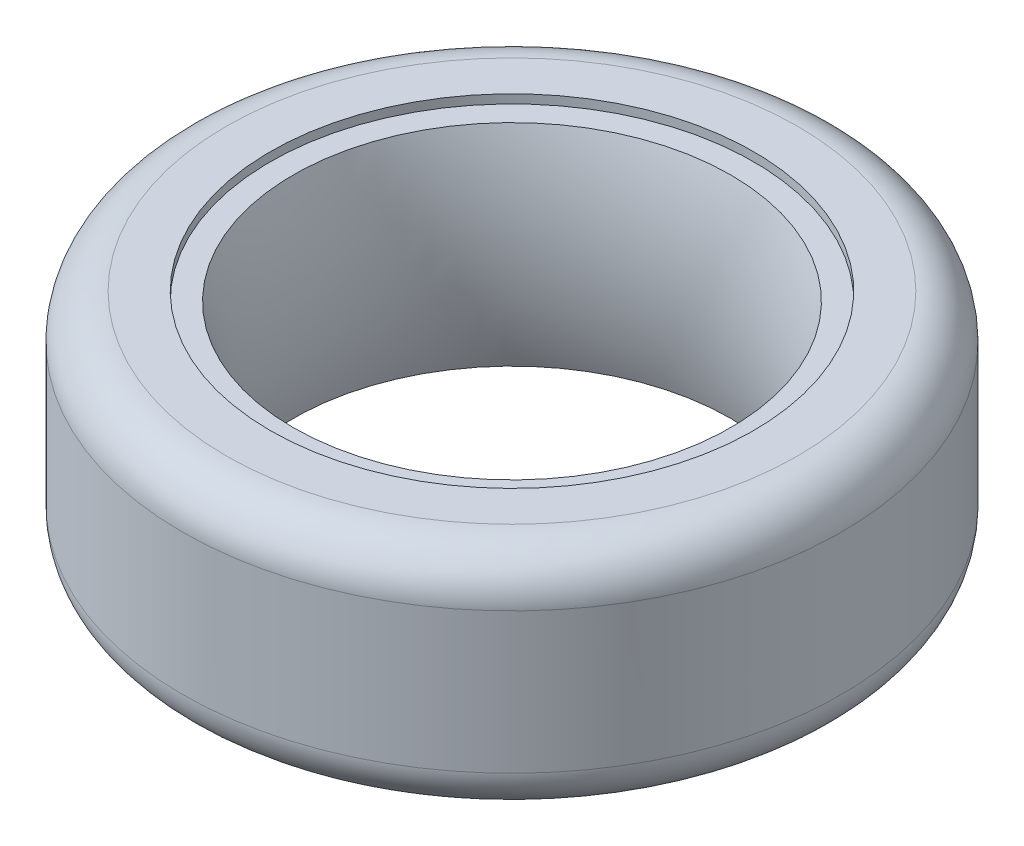
ISO-10303-21;
HEADER;
FILE_DESCRIPTION(('STEP AP214'),'2;1');
FILE_NAME('part.step','',(''),(''),'','','');
FILE_SCHEMA(('AUTOMOTIVE_DESIGN { 1 0 10303 214 1 1 1 1 }'));
ENDSEC;
DATA;
#1=APPLICATION_CONTEXT('core data for automotive mechanical design processes');
#2=APPLICATION_PROTOCOL_DEFINITION('international standard','automotive_design',2000,#1);
#3=PRODUCT_CONTEXT('',#1,'mechanical');
#4=PRODUCT('Part','Part','',(#3));
#5=PRODUCT_RELATED_PRODUCT_CATEGORY('part','',(#4));
#6=PRODUCT_DEFINITION_FORMATION('','',#4);
#7=PRODUCT_DEFINITION_CONTEXT('part definition',#1,'design');
#8=PRODUCT_DEFINITION('design','',#6,#7);
#9=PRODUCT_DEFINITION_SHAPE('','',#8);
#10=(LENGTH_UNIT() NAMED_UNIT(*) SI_UNIT(.MILLI.,.METRE.));
#11=(NAMED_UNIT(*) PLANE_ANGLE_UNIT() SI_UNIT($,.RADIAN.));
#12=(NAMED_UNIT(*) SI_UNIT($,.STERADIAN.) SOLID_ANGLE_UNIT());
#13=UNCERTAINTY_MEASURE_WITH_UNIT(LENGTH_MEASURE(1.E-05),#10,'distance_accuracy_value','');
#14=(GEOMETRIC_REPRESENTATION_CONTEXT(3) GLOBAL_UNCERTAINTY_ASSIGNED_CONTEXT((#13)) GLOBAL_UNIT_ASSIGNED_CONTEXT((#10,
#11,#12)) REPRESENTATION_CONTEXT('',''));
#15=CARTESIAN_POINT('',(0.,0.,0.));
#16=DIRECTION('',(0.,0.,1.));
#17=DIRECTION('',(1.,0.,0.));
#18=AXIS2_PLACEMENT_3D('',#15,#16,#17);
#19=CARTESIAN_POINT('',(0.,0.,0.));
#20=DIRECTION('',(0.,1.,0.));
#21=DIRECTION('',(0.,0.,1.));
#22=AXIS2_PLACEMENT_3D('',#19,#20,#21);
#23=TOROIDAL_SURFACE('',#22,63.0575680566778,40.);
#24=CARTESIAN_POINT('',(0.,-12.,0.));
#25=DIRECTION('',(0.,1.,0.));
#26=DIRECTION('',(0.,0.,1.));
#27=AXIS2_PLACEMENT_3D('',#24,#25,#26);
#28=CIRCLE('',#27,24.9);
#29=CARTESIAN_POINT('',(0.,-12.,24.9));
#30=VERTEX_POINT('',#29);
#31=EDGE_CURVE('E65',#30,#30,#28,.T.);
#32=ORIENTED_EDGE('',*,*,#31,.F.);
#33=EDGE_LOOP('',(#32));
#34=FACE_BOUND('',#33,.T.);
#35=CARTESIAN_POINT('',(0.,12.,0.));
#36=DIRECTION('',(0.,1.,0.));
#37=DIRECTION('',(0.,0.,1.));
#38=AXIS2_PLACEMENT_3D('',#35,#36,#37);
#39=CIRCLE('',#38,24.9);
#40=CARTESIAN_POINT('',(0.,12.,24.9));
#41=VERTEX_POINT('',#40);
#42=EDGE_CURVE('E50',#41,#41,#39,.T.);
#43=ORIENTED_EDGE('',*,*,#42,.T.);
#44=EDGE_LOOP('',(#43));
#45=FACE_BOUND('',#44,.T.);
#46=ADVANCED_FACE('F30',(#34,#45),#23,.T.);
#47=CARTESIAN_POINT('',(0.,12.,0.));
#48=DIRECTION('',(0.,-1.,0.));
#49=DIRECTION('',(0.,0.,-1.));
#50=AXIS2_PLACEMENT_3D('',#47,#48,#49);
#51=PLANE('',#50);
#52=ORIENTED_EDGE('',*,*,#42,.F.);
#53=EDGE_LOOP('',(#52));
#54=FACE_BOUND('',#53,.T.);
#55=CARTESIAN_POINT('',(0.,12.,0.));
#56=DIRECTION('',(0.,1.,0.));
#57=DIRECTION('',(0.,0.,1.));
#58=AXIS2_PLACEMENT_3D('',#55,#56,#57);
#59=CIRCLE('',#58,27.5);
#60=CARTESIAN_POINT('',(0.,12.,27.5));
#61=VERTEX_POINT('',#60);
#62=EDGE_CURVE('E53',#61,#61,#59,.T.);
#63=ORIENTED_EDGE('',*,*,#62,.T.);
#64=EDGE_LOOP('',(#63));
#65=FACE_BOUND('',#64,.T.);
#66=ADVANCED_FACE('F73',(#54,#65),#51,.F.);
#67=CARTESIAN_POINT('',(0.,39.1439042874109,0.));
#68=DIRECTION('',(0.,1.,0.));
#69=DIRECTION('',(0.,0.,1.));
#70=AXIS2_PLACEMENT_3D('',#67,#68,#69);
#71=CYLINDRICAL_SURFACE('',#70,27.5);
#72=CARTESIAN_POINT('',(0.,13.,0.));
#73=DIRECTION('',(0.,1.,0.));
#74=DIRECTION('',(0.,0.,1.));
#75=AXIS2_PLACEMENT_3D('',#72,#73,#74);
#76=CIRCLE('',#75,27.5);
#77=CARTESIAN_POINT('',(0.,13.,27.5));
#78=VERTEX_POINT('',#77);
#79=EDGE_CURVE('E56',#78,#78,#76,.T.);
#80=ORIENTED_EDGE('',*,*,#79,.T.);
#81=EDGE_LOOP('',(#80));
#82=FACE_BOUND('',#81,.T.);
#83=ORIENTED_EDGE('',*,*,#62,.F.);
#84=EDGE_LOOP('',(#83));
#85=FACE_BOUND('',#84,.T.);
#86=ADVANCED_FACE('F79',(#82,#85),#71,.F.);
#87=CARTESIAN_POINT('',(0.,13.,0.));
#88=DIRECTION('',(0.,1.,0.));
#89=DIRECTION('',(0.,0.,1.));
#90=AXIS2_PLACEMENT_3D('',#87,#88,#89);
#91=PLANE('',#90);
#92=CARTESIAN_POINT('',(0.,13.,0.));
#93=DIRECTION('',(0.,1.,0.));
#94=DIRECTION('',(0.,0.,1.));
#95=AXIS2_PLACEMENT_3D('',#92,#93,#94);
#96=CIRCLE('',#95,32.5);
#97=CARTESIAN_POINT('',(0.,13.,32.5));
#98=VERTEX_POINT('',#97);
#99=EDGE_CURVE('E45',#98,#98,#96,.T.);
#100=ORIENTED_EDGE('',*,*,#99,.T.);
#101=EDGE_LOOP('',(#100));
#102=FACE_BOUND('',#101,.T.);
#103=ORIENTED_EDGE('',*,*,#79,.F.);
#104=EDGE_LOOP('',(#103));
#105=FACE_BOUND('',#104,.T.);
#106=ADVANCED_FACE('F84',(#102,#105),#91,.T.);
#107=CARTESIAN_POINT('',(0.,39.1439042874109,0.));
#108=DIRECTION('',(0.,1.,0.));
#109=DIRECTION('',(0.,0.,1.));
#110=AXIS2_PLACEMENT_3D('',#107,#108,#109);
#111=CYLINDRICAL_SURFACE('',#110,37.5);
#112=CARTESIAN_POINT('',(0.,8.00000000000001,0.));
#113=DIRECTION('',(0.,1.,0.));
#114=DIRECTION('',(0.,0.,1.));
#115=AXIS2_PLACEMENT_3D('',#112,#113,#114);
#116=CIRCLE('',#115,37.5);
#117=CARTESIAN_POINT('',(0.,8.00000000000001,37.5));
#118=VERTEX_POINT('',#117);
#119=EDGE_CURVE('E37',#118,#118,#116,.F.);
#120=ORIENTED_EDGE('',*,*,#119,.T.);
#121=EDGE_LOOP('',(#120));
#122=FACE_BOUND('',#121,.T.);
#123=CARTESIAN_POINT('',(0.,-7.99999999999998,0.));
#124=DIRECTION('',(0.,-1.,0.));
#125=DIRECTION('',(0.,0.,-1.));
#126=AXIS2_PLACEMENT_3D('',#123,#124,#125);
#127=CIRCLE('',#126,37.5);
#128=CARTESIAN_POINT('',(0.,-7.99999999999998,-37.5));
#129=VERTEX_POINT('',#128);
#130=EDGE_CURVE('E41',#129,#129,#127,.F.);
#131=ORIENTED_EDGE('',*,*,#130,.T.);
#132=EDGE_LOOP('',(#131));
#133=FACE_BOUND('',#132,.T.);
#134=ADVANCED_FACE('F90',(#122,#133),#111,.T.);
#135=CARTESIAN_POINT('',(0.,-13.,0.));
#136=DIRECTION('',(0.,-1.,0.));
#137=DIRECTION('',(0.,0.,-1.));
#138=AXIS2_PLACEMENT_3D('',#135,#136,#137);
#139=PLANE('',#138);
#140=CARTESIAN_POINT('',(0.,-13.,0.));
#141=DIRECTION('',(0.,-1.,0.));
#142=DIRECTION('',(0.,0.,-1.));
#143=AXIS2_PLACEMENT_3D('',#140,#141,#142);
#144=CIRCLE('',#143,32.5);
#145=CARTESIAN_POINT('',(0.,-13.,-32.5));
#146=VERTEX_POINT('',#145);
#147=EDGE_CURVE('E10',#146,#146,#144,.T.);
#148=ORIENTED_EDGE('',*,*,#147,.T.);
#149=EDGE_LOOP('',(#148));
#150=FACE_BOUND('',#149,.T.);
#151=CARTESIAN_POINT('',(0.,-13.,0.));
#152=DIRECTION('',(0.,1.,0.));
#153=DIRECTION('',(0.,0.,1.));
#154=AXIS2_PLACEMENT_3D('',#151,#152,#153);
#155=CIRCLE('',#154,27.5);
#156=CARTESIAN_POINT('',(0.,-13.,27.5));
#157=VERTEX_POINT('',#156);
#158=EDGE_CURVE('E59',#157,#157,#155,.T.);
#159=ORIENTED_EDGE('',*,*,#158,.T.);
#160=EDGE_LOOP('',(#159));
#161=FACE_BOUND('',#160,.T.);
#162=ADVANCED_FACE('F112',(#150,#161),#139,.T.);
#163=CARTESIAN_POINT('',(0.,39.1439042874109,0.));
#164=DIRECTION('',(0.,1.,0.));
#165=DIRECTION('',(0.,0.,1.));
#166=AXIS2_PLACEMENT_3D('',#163,#164,#165);
#167=CYLINDRICAL_SURFACE('',#166,27.5);
#168=CARTESIAN_POINT('',(0.,-12.,0.));
#169=DIRECTION('',(0.,1.,0.));
#170=DIRECTION('',(0.,0.,1.));
#171=AXIS2_PLACEMENT_3D('',#168,#169,#170);
#172=CIRCLE('',#171,27.5);
#173=CARTESIAN_POINT('',(0.,-12.,27.5));
#174=VERTEX_POINT('',#173);
#175=EDGE_CURVE('E62',#174,#174,#172,.T.);
#176=ORIENTED_EDGE('',*,*,#175,.T.);
#177=EDGE_LOOP('',(#176));
#178=FACE_BOUND('',#177,.T.);
#179=ORIENTED_EDGE('',*,*,#158,.F.);
#180=EDGE_LOOP('',(#179));
#181=FACE_BOUND('',#180,.T.);
#182=ADVANCED_FACE('F102',(#178,#181),#167,.F.);
#183=CARTESIAN_POINT('',(0.,-12.,0.));
#184=DIRECTION('',(0.,1.,0.));
#185=DIRECTION('',(0.,0.,1.));
#186=AXIS2_PLACEMENT_3D('',#183,#184,#185);
#187=PLANE('',#186);
#188=ORIENTED_EDGE('',*,*,#175,.F.);
#189=EDGE_LOOP('',(#188));
#190=FACE_BOUND('',#189,.T.);
#191=ORIENTED_EDGE('',*,*,#31,.T.);
#192=EDGE_LOOP('',(#191));
#193=FACE_BOUND('',#192,.T.);
#194=ADVANCED_FACE('F69',(#190,#193),#187,.F.);
#195=CARTESIAN_POINT('',(0.,8.00000000000001,0.));
#196=DIRECTION('',(0.,1.,0.));
#197=DIRECTION('',(0.,0.,1.));
#198=AXIS2_PLACEMENT_3D('',#195,#196,#197);
#199=TOROIDAL_SURFACE('',#198,32.5,5.);
#200=ORIENTED_EDGE('',*,*,#119,.F.);
#201=EDGE_LOOP('',(#200));
#202=FACE_BOUND('',#201,.T.);
#203=ORIENTED_EDGE('',*,*,#99,.F.);
#204=EDGE_LOOP('',(#203));
#205=FACE_BOUND('',#204,.T.);
#206=ADVANCED_FACE('F94',(#202,#205),#199,.T.);
#207=CARTESIAN_POINT('',(0.,-7.99999999999998,0.));
#208=DIRECTION('',(0.,-1.,0.));
#209=DIRECTION('',(0.,0.,-1.));
#210=AXIS2_PLACEMENT_3D('',#207,#208,#209);
#211=TOROIDAL_SURFACE('',#210,32.5,5.);
#212=ORIENTED_EDGE('',*,*,#147,.F.);
#213=EDGE_LOOP('',(#212));
#214=FACE_BOUND('',#213,.T.);
#215=ORIENTED_EDGE('',*,*,#130,.F.);
#216=EDGE_LOOP('',(#215));
#217=FACE_BOUND('',#216,.T.);
#218=ADVANCED_FACE('F32',(#214,#217),#211,.T.);
#219=CLOSED_SHELL('',(#46,#66,#86,#106,#134,#162,#182,#194,#206,#218));
#220=MANIFOLD_SOLID_BREP('B2',#219);
#221=ADVANCED_BREP_SHAPE_REPRESENTATION('',(#18,#220),#14);
#222=SHAPE_DEFINITION_REPRESENTATION(#9,#221);
ENDSEC;
END-ISO-10303-21;
